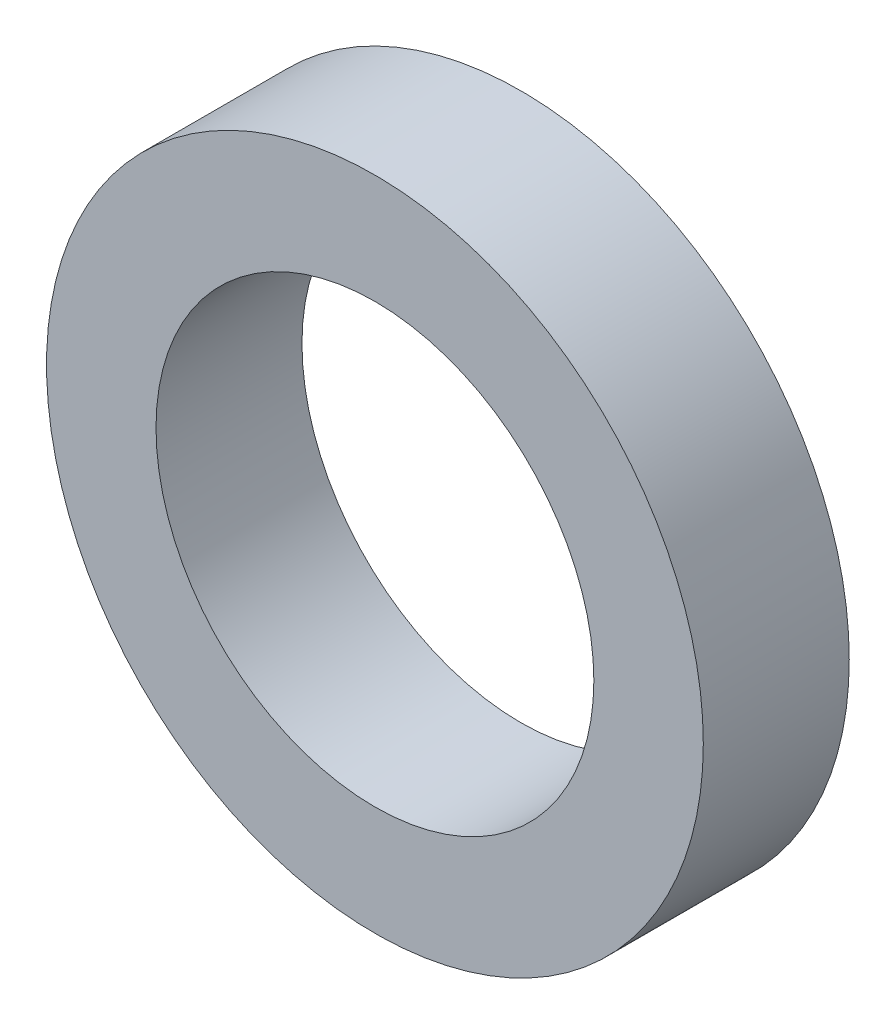
ISO-10303-21;
HEADER;
FILE_DESCRIPTION(('STEP AP214'),'2;1');
FILE_NAME('part.step','',(''),(''),'','','');
FILE_SCHEMA(('AUTOMOTIVE_DESIGN { 1 0 10303 214 1 1 1 1 }'));
ENDSEC;
DATA;
#1=APPLICATION_CONTEXT('core data for automotive mechanical design processes');
#2=APPLICATION_PROTOCOL_DEFINITION('international standard','automotive_design',2000,#1);
#3=PRODUCT_CONTEXT('',#1,'mechanical');
#4=PRODUCT('Part','Part','',(#3));
#5=PRODUCT_RELATED_PRODUCT_CATEGORY('part','',(#4));
#6=PRODUCT_DEFINITION_FORMATION('','',#4);
#7=PRODUCT_DEFINITION_CONTEXT('part definition',#1,'design');
#8=PRODUCT_DEFINITION('design','',#6,#7);
#9=PRODUCT_DEFINITION_SHAPE('','',#8);
#10=(LENGTH_UNIT() NAMED_UNIT(*) SI_UNIT(.MILLI.,.METRE.));
#11=(NAMED_UNIT(*) PLANE_ANGLE_UNIT() SI_UNIT($,.RADIAN.));
#12=(NAMED_UNIT(*) SI_UNIT($,.STERADIAN.) SOLID_ANGLE_UNIT());
#13=UNCERTAINTY_MEASURE_WITH_UNIT(LENGTH_MEASURE(1.E-05),#10,'distance_accuracy_value','');
#14=(GEOMETRIC_REPRESENTATION_CONTEXT(3) GLOBAL_UNCERTAINTY_ASSIGNED_CONTEXT((#13)) GLOBAL_UNIT_ASSIGNED_CONTEXT((#10,
#11,#12)) REPRESENTATION_CONTEXT('',''));
#15=CARTESIAN_POINT('',(0.,0.,0.));
#16=DIRECTION('',(0.,0.,1.));
#17=DIRECTION('',(1.,0.,0.));
#18=AXIS2_PLACEMENT_3D('',#15,#16,#17);
#19=CARTESIAN_POINT('',(0.,0.,4.));
#20=DIRECTION('',(0.,0.,1.));
#21=DIRECTION('',(1.,0.,0.));
#22=AXIS2_PLACEMENT_3D('',#19,#20,#21);
#23=PLANE('',#22);
#24=CARTESIAN_POINT('',(0.,0.,4.));
#25=DIRECTION('',(0.,0.,1.));
#26=DIRECTION('',(1.,0.,0.));
#27=AXIS2_PLACEMENT_3D('',#24,#25,#26);
#28=CIRCLE('',#27,9.);
#29=CARTESIAN_POINT('',(9.,0.,4.));
#30=VERTEX_POINT('',#29);
#31=EDGE_CURVE('E10',#30,#30,#28,.T.);
#32=ORIENTED_EDGE('',*,*,#31,.T.);
#33=EDGE_LOOP('',(#32));
#34=FACE_BOUND('',#33,.T.);
#35=CARTESIAN_POINT('',(0.,0.,4.));
#36=DIRECTION('',(0.,0.,1.));
#37=DIRECTION('',(1.,0.,0.));
#38=AXIS2_PLACEMENT_3D('',#35,#36,#37);
#39=CIRCLE('',#38,6.);
#40=CARTESIAN_POINT('',(6.,0.,4.));
#41=VERTEX_POINT('',#40);
#42=EDGE_CURVE('E48',#41,#41,#39,.T.);
#43=ORIENTED_EDGE('',*,*,#42,.F.);
#44=EDGE_LOOP('',(#43));
#45=FACE_BOUND('',#44,.T.);
#46=ADVANCED_FACE('F37',(#34,#45),#23,.T.);
#47=CARTESIAN_POINT('',(0.,0.,0.));
#48=DIRECTION('',(0.,0.,1.));
#49=DIRECTION('',(1.,0.,0.));
#50=AXIS2_PLACEMENT_3D('',#47,#48,#49);
#51=PLANE('',#50);
#52=CARTESIAN_POINT('',(0.,0.,0.));
#53=DIRECTION('',(0.,0.,1.));
#54=DIRECTION('',(1.,0.,0.));
#55=AXIS2_PLACEMENT_3D('',#52,#53,#54);
#56=CIRCLE('',#55,9.);
#57=CARTESIAN_POINT('',(9.,0.,0.));
#58=VERTEX_POINT('',#57);
#59=EDGE_CURVE('E41',#58,#58,#56,.T.);
#60=ORIENTED_EDGE('',*,*,#59,.F.);
#61=EDGE_LOOP('',(#60));
#62=FACE_BOUND('',#61,.T.);
#63=CARTESIAN_POINT('',(0.,0.,0.));
#64=DIRECTION('',(0.,0.,1.));
#65=DIRECTION('',(1.,0.,0.));
#66=AXIS2_PLACEMENT_3D('',#63,#64,#65);
#67=CIRCLE('',#66,6.);
#68=CARTESIAN_POINT('',(6.,0.,0.));
#69=VERTEX_POINT('',#68);
#70=EDGE_CURVE('E50',#69,#69,#67,.T.);
#71=ORIENTED_EDGE('',*,*,#70,.T.);
#72=EDGE_LOOP('',(#71));
#73=FACE_BOUND('',#72,.T.);
#74=ADVANCED_FACE('F60',(#62,#73),#51,.F.);
#75=CARTESIAN_POINT('',(0.,0.,4.));
#76=DIRECTION('',(0.,0.,-1.));
#77=DIRECTION('',(-1.,0.,0.));
#78=AXIS2_PLACEMENT_3D('',#75,#76,#77);
#79=CYLINDRICAL_SURFACE('',#78,9.);
#80=ORIENTED_EDGE('',*,*,#31,.F.);
#81=EDGE_LOOP('',(#80));
#82=FACE_BOUND('',#81,.T.);
#83=ORIENTED_EDGE('',*,*,#59,.T.);
#84=EDGE_LOOP('',(#83));
#85=FACE_BOUND('',#84,.T.);
#86=ADVANCED_FACE('F39',(#82,#85),#79,.T.);
#87=CARTESIAN_POINT('',(0.,0.,4.));
#88=DIRECTION('',(0.,0.,-1.));
#89=DIRECTION('',(-1.,0.,0.));
#90=AXIS2_PLACEMENT_3D('',#87,#88,#89);
#91=CYLINDRICAL_SURFACE('',#90,6.);
#92=ORIENTED_EDGE('',*,*,#42,.T.);
#93=EDGE_LOOP('',(#92));
#94=FACE_BOUND('',#93,.T.);
#95=ORIENTED_EDGE('',*,*,#70,.F.);
#96=EDGE_LOOP('',(#95));
#97=FACE_BOUND('',#96,.T.);
#98=ADVANCED_FACE('F56',(#94,#97),#91,.F.);
#99=CLOSED_SHELL('',(#46,#74,#86,#98));
#100=MANIFOLD_SOLID_BREP('B2',#99);
#101=ADVANCED_BREP_SHAPE_REPRESENTATION('',(#18,#100),#14);
#102=SHAPE_DEFINITION_REPRESENTATION(#9,#101);
ENDSEC;
END-ISO-10303-21;
